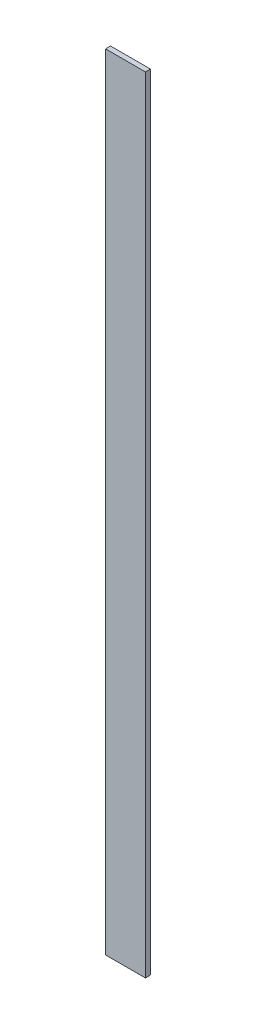
ISO-10303-21;
HEADER;
FILE_DESCRIPTION(('STEP AP214'),'2;1');
FILE_NAME('part.step','',(''),(''),'','','');
FILE_SCHEMA(('AUTOMOTIVE_DESIGN { 1 0 10303 214 1 1 1 1 }'));
ENDSEC;
DATA;
#1=APPLICATION_CONTEXT('core data for automotive mechanical design processes');
#2=APPLICATION_PROTOCOL_DEFINITION('international standard','automotive_design',2000,#1);
#3=PRODUCT_CONTEXT('',#1,'mechanical');
#4=PRODUCT('Part','Part','',(#3));
#5=PRODUCT_RELATED_PRODUCT_CATEGORY('part','',(#4));
#6=PRODUCT_DEFINITION_FORMATION('','',#4);
#7=PRODUCT_DEFINITION_CONTEXT('part definition',#1,'design');
#8=PRODUCT_DEFINITION('design','',#6,#7);
#9=PRODUCT_DEFINITION_SHAPE('','',#8);
#10=(LENGTH_UNIT() NAMED_UNIT(*) SI_UNIT(.MILLI.,.METRE.));
#11=(NAMED_UNIT(*) PLANE_ANGLE_UNIT() SI_UNIT($,.RADIAN.));
#12=(NAMED_UNIT(*) SI_UNIT($,.STERADIAN.) SOLID_ANGLE_UNIT());
#13=UNCERTAINTY_MEASURE_WITH_UNIT(LENGTH_MEASURE(1.E-05),#10,'distance_accuracy_value','');
#14=(GEOMETRIC_REPRESENTATION_CONTEXT(3) GLOBAL_UNCERTAINTY_ASSIGNED_CONTEXT((#13)) GLOBAL_UNIT_ASSIGNED_CONTEXT((#10,
#11,#12)) REPRESENTATION_CONTEXT('',''));
#15=CARTESIAN_POINT('',(0.,0.,0.));
#16=DIRECTION('',(0.,0.,1.));
#17=DIRECTION('',(1.,0.,0.));
#18=AXIS2_PLACEMENT_3D('',#15,#16,#17);
#19=CARTESIAN_POINT('',(0.,0.,2.38125));
#20=DIRECTION('',(0.,0.,1.));
#21=DIRECTION('',(1.,0.,0.));
#22=AXIS2_PLACEMENT_3D('',#19,#20,#21);
#23=PLANE('',#22);
#24=DIRECTION('',(1.,0.,0.));
#25=VECTOR('',#24,1.);
#26=CARTESIAN_POINT('',(9.525,187.325,2.38125));
#27=LINE('',#26,#25);
#28=CARTESIAN_POINT('',(-9.525,187.325,2.38125));
#29=VERTEX_POINT('',#28);
#30=CARTESIAN_POINT('',(9.525,187.325,2.38125));
#31=VERTEX_POINT('',#30);
#32=EDGE_CURVE('E68',#29,#31,#27,.T.);
#33=ORIENTED_EDGE('',*,*,#32,.F.);
#34=DIRECTION('',(0.,1.,0.));
#35=VECTOR('',#34,1.);
#36=CARTESIAN_POINT('',(-9.525,187.325,2.38125));
#37=LINE('',#36,#35);
#38=CARTESIAN_POINT('',(-9.525,-187.325,2.38125));
#39=VERTEX_POINT('',#38);
#40=EDGE_CURVE('E20',#39,#29,#37,.T.);
#41=ORIENTED_EDGE('',*,*,#40,.F.);
#42=DIRECTION('',(1.,0.,0.));
#43=VECTOR('',#42,1.);
#44=CARTESIAN_POINT('',(-9.525,-187.325,2.38125));
#45=LINE('',#44,#43);
#46=CARTESIAN_POINT('',(9.525,-187.325,2.38125));
#47=VERTEX_POINT('',#46);
#48=EDGE_CURVE('E58',#47,#39,#45,.F.);
#49=ORIENTED_EDGE('',*,*,#48,.F.);
#50=DIRECTION('',(0.,1.,0.));
#51=VECTOR('',#50,1.);
#52=CARTESIAN_POINT('',(9.525,-187.325,2.38125));
#53=LINE('',#52,#51);
#54=EDGE_CURVE('E53',#31,#47,#53,.F.);
#55=ORIENTED_EDGE('',*,*,#54,.F.);
#56=EDGE_LOOP('',(#33,#41,#49,#55));
#57=FACE_BOUND('',#56,.T.);
#58=ADVANCED_FACE('F17',(#57),#23,.T.);
#59=CARTESIAN_POINT('',(-9.525,187.325,0.));
#60=DIRECTION('',(-1.,0.,0.));
#61=DIRECTION('',(0.,0.,1.));
#62=AXIS2_PLACEMENT_3D('',#59,#60,#61);
#63=PLANE('',#62);
#64=DIRECTION('',(0.,0.,1.));
#65=VECTOR('',#64,1.);
#66=CARTESIAN_POINT('',(-9.525,187.325,0.));
#67=LINE('',#66,#65);
#68=CARTESIAN_POINT('',(-9.525,187.325,0.));
#69=VERTEX_POINT('',#68);
#70=EDGE_CURVE('E79',#69,#29,#67,.T.);
#71=ORIENTED_EDGE('',*,*,#70,.F.);
#72=DIRECTION('',(0.,1.,0.));
#73=VECTOR('',#72,1.);
#74=CARTESIAN_POINT('',(-9.525,0.,0.));
#75=LINE('',#74,#73);
#76=CARTESIAN_POINT('',(-9.525,-187.325,0.));
#77=VERTEX_POINT('',#76);
#78=EDGE_CURVE('E74',#69,#77,#75,.F.);
#79=ORIENTED_EDGE('',*,*,#78,.T.);
#80=DIRECTION('',(0.,0.,-1.));
#81=VECTOR('',#80,1.);
#82=CARTESIAN_POINT('',(-9.525,-187.325,0.));
#83=LINE('',#82,#81);
#84=EDGE_CURVE('E63',#39,#77,#83,.T.);
#85=ORIENTED_EDGE('',*,*,#84,.F.);
#86=ORIENTED_EDGE('',*,*,#40,.T.);
#87=EDGE_LOOP('',(#71,#79,#85,#86));
#88=FACE_BOUND('',#87,.T.);
#89=ADVANCED_FACE('F73',(#88),#63,.T.);
#90=CARTESIAN_POINT('',(-9.525,-187.325,0.));
#91=DIRECTION('',(0.,-1.,0.));
#92=DIRECTION('',(0.,0.,-1.));
#93=AXIS2_PLACEMENT_3D('',#90,#91,#92);
#94=PLANE('',#93);
#95=ORIENTED_EDGE('',*,*,#84,.T.);
#96=DIRECTION('',(1.,0.,0.));
#97=VECTOR('',#96,1.);
#98=CARTESIAN_POINT('',(0.,-187.325,0.));
#99=LINE('',#98,#97);
#100=CARTESIAN_POINT('',(9.525,-187.325,0.));
#101=VERTEX_POINT('',#100);
#102=EDGE_CURVE('E84',#77,#101,#99,.T.);
#103=ORIENTED_EDGE('',*,*,#102,.T.);
#104=DIRECTION('',(0.,0.,-1.));
#105=VECTOR('',#104,1.);
#106=CARTESIAN_POINT('',(9.525,-187.325,0.));
#107=LINE('',#106,#105);
#108=EDGE_CURVE('E65',#47,#101,#107,.T.);
#109=ORIENTED_EDGE('',*,*,#108,.F.);
#110=ORIENTED_EDGE('',*,*,#48,.T.);
#111=EDGE_LOOP('',(#95,#103,#109,#110));
#112=FACE_BOUND('',#111,.T.);
#113=ADVANCED_FACE('F60',(#112),#94,.T.);
#114=CARTESIAN_POINT('',(9.525,-187.325,0.));
#115=DIRECTION('',(1.,0.,0.));
#116=DIRECTION('',(0.,0.,-1.));
#117=AXIS2_PLACEMENT_3D('',#114,#115,#116);
#118=PLANE('',#117);
#119=ORIENTED_EDGE('',*,*,#108,.T.);
#120=DIRECTION('',(0.,1.,0.));
#121=VECTOR('',#120,1.);
#122=CARTESIAN_POINT('',(9.525,0.,0.));
#123=LINE('',#122,#121);
#124=CARTESIAN_POINT('',(9.525,187.325,0.));
#125=VERTEX_POINT('',#124);
#126=EDGE_CURVE('E26',#101,#125,#123,.T.);
#127=ORIENTED_EDGE('',*,*,#126,.T.);
#128=DIRECTION('',(0.,0.,1.));
#129=VECTOR('',#128,1.);
#130=CARTESIAN_POINT('',(9.525,187.325,0.));
#131=LINE('',#130,#129);
#132=EDGE_CURVE('E34',#31,#125,#131,.F.);
#133=ORIENTED_EDGE('',*,*,#132,.F.);
#134=ORIENTED_EDGE('',*,*,#54,.T.);
#135=EDGE_LOOP('',(#119,#127,#133,#134));
#136=FACE_BOUND('',#135,.T.);
#137=ADVANCED_FACE('F88',(#136),#118,.T.);
#138=CARTESIAN_POINT('',(9.525,187.325,0.));
#139=DIRECTION('',(0.,1.,0.));
#140=DIRECTION('',(0.,0.,1.));
#141=AXIS2_PLACEMENT_3D('',#138,#139,#140);
#142=PLANE('',#141);
#143=ORIENTED_EDGE('',*,*,#132,.T.);
#144=DIRECTION('',(1.,0.,0.));
#145=VECTOR('',#144,1.);
#146=CARTESIAN_POINT('',(0.,187.325,0.));
#147=LINE('',#146,#145);
#148=EDGE_CURVE('E11',#125,#69,#147,.F.);
#149=ORIENTED_EDGE('',*,*,#148,.T.);
#150=ORIENTED_EDGE('',*,*,#70,.T.);
#151=ORIENTED_EDGE('',*,*,#32,.T.);
#152=EDGE_LOOP('',(#143,#149,#150,#151));
#153=FACE_BOUND('',#152,.T.);
#154=ADVANCED_FACE('F91',(#153),#142,.T.);
#155=CARTESIAN_POINT('',(0.,0.,0.));
#156=DIRECTION('',(0.,0.,1.));
#157=DIRECTION('',(1.,0.,0.));
#158=AXIS2_PLACEMENT_3D('',#155,#156,#157);
#159=PLANE('',#158);
#160=ORIENTED_EDGE('',*,*,#126,.F.);
#161=ORIENTED_EDGE('',*,*,#102,.F.);
#162=ORIENTED_EDGE('',*,*,#78,.F.);
#163=ORIENTED_EDGE('',*,*,#148,.F.);
#164=EDGE_LOOP('',(#160,#161,#162,#163));
#165=FACE_BOUND('',#164,.T.);
#166=ADVANCED_FACE('F90',(#165),#159,.F.);
#167=CLOSED_SHELL('',(#58,#89,#113,#137,#154,#166));
#168=MANIFOLD_SOLID_BREP('B1',#167);
#169=ADVANCED_BREP_SHAPE_REPRESENTATION('',(#18,#168),#14);
#170=SHAPE_DEFINITION_REPRESENTATION(#9,#169);
ENDSEC;
END-ISO-10303-21;
